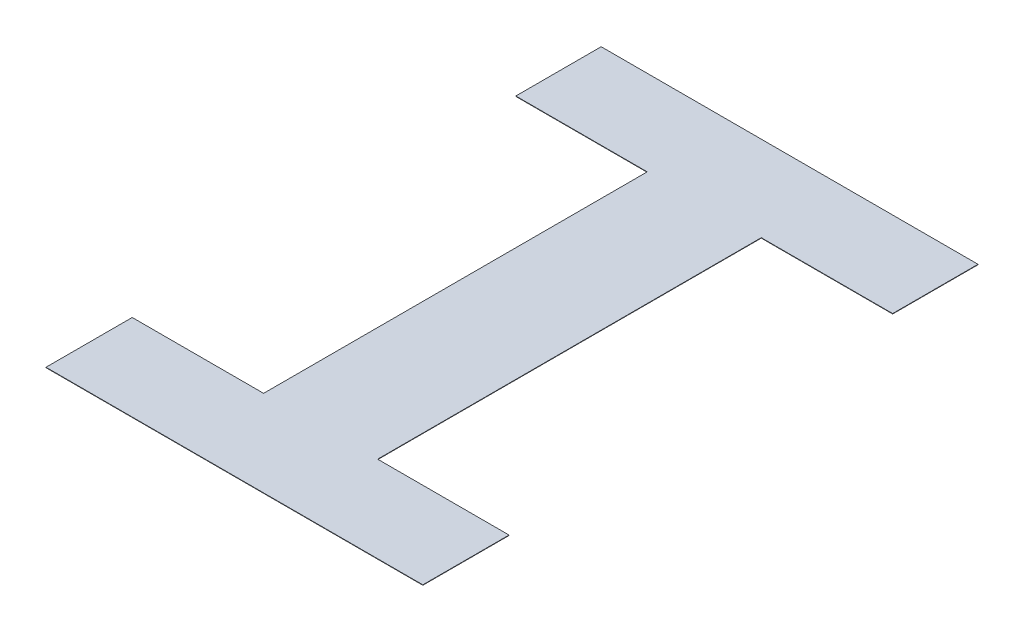
ISO-10303-21;
HEADER;
FILE_DESCRIPTION(('STEP AP214'),'2;1');
FILE_NAME('part.step','',(''),(''),'','','');
FILE_SCHEMA(('AUTOMOTIVE_DESIGN { 1 0 10303 214 1 1 1 1 }'));
ENDSEC;
DATA;
#1=APPLICATION_CONTEXT('core data for automotive mechanical design processes');
#2=APPLICATION_PROTOCOL_DEFINITION('international standard','automotive_design',2000,#1);
#3=PRODUCT_CONTEXT('',#1,'mechanical');
#4=PRODUCT('Part','Part','',(#3));
#5=PRODUCT_RELATED_PRODUCT_CATEGORY('part','',(#4));
#6=PRODUCT_DEFINITION_FORMATION('','',#4);
#7=PRODUCT_DEFINITION_CONTEXT('part definition',#1,'design');
#8=PRODUCT_DEFINITION('design','',#6,#7);
#9=PRODUCT_DEFINITION_SHAPE('','',#8);
#10=(LENGTH_UNIT() NAMED_UNIT(*) SI_UNIT(.MILLI.,.METRE.));
#11=(NAMED_UNIT(*) PLANE_ANGLE_UNIT() SI_UNIT($,.RADIAN.));
#12=(NAMED_UNIT(*) SI_UNIT($,.STERADIAN.) SOLID_ANGLE_UNIT());
#13=UNCERTAINTY_MEASURE_WITH_UNIT(LENGTH_MEASURE(1.E-05),#10,'distance_accuracy_value','');
#14=(GEOMETRIC_REPRESENTATION_CONTEXT(3) GLOBAL_UNCERTAINTY_ASSIGNED_CONTEXT((#13)) GLOBAL_UNIT_ASSIGNED_CONTEXT((#10,
#11,#12)) REPRESENTATION_CONTEXT('',''));
#15=CARTESIAN_POINT('',(0.,0.,0.));
#16=DIRECTION('',(0.,0.,1.));
#17=DIRECTION('',(1.,0.,0.));
#18=AXIS2_PLACEMENT_3D('',#15,#16,#17);
#19=CARTESIAN_POINT('',(26.67,0.00149999999999997,0.));
#20=DIRECTION('',(0.,1.,0.));
#21=DIRECTION('',(0.,0.,1.));
#22=AXIS2_PLACEMENT_3D('',#19,#20,#21);
#23=PLANE('',#22);
#24=DIRECTION('',(0.,0.,1.));
#25=VECTOR('',#24,1.);
#26=CARTESIAN_POINT('',(11.9767874545668,0.00149999999999997,-82.2962675864307));
#27=LINE('',#26,#25);
#28=CARTESIAN_POINT('',(11.9767874545668,0.00149999999999997,-83.6782671330188));
#29=VERTEX_POINT('',#28);
#30=CARTESIAN_POINT('',(11.9767874545668,0.00149999999999997,-82.2962675864307));
#31=VERTEX_POINT('',#30);
#32=EDGE_CURVE('E132',#29,#31,#27,.T.);
#33=ORIENTED_EDGE('',*,*,#32,.T.);
#34=DIRECTION('',(1.,0.,0.));
#35=VECTOR('',#34,1.);
#36=CARTESIAN_POINT('',(12.4501495039887,0.00149999999999997,-82.2962675864307));
#37=LINE('',#36,#35);
#38=CARTESIAN_POINT('',(12.4501495039887,0.00149999999999997,-82.2962675864307));
#39=VERTEX_POINT('',#38);
#40=EDGE_CURVE('E137',#31,#39,#37,.T.);
#41=ORIENTED_EDGE('',*,*,#40,.T.);
#42=DIRECTION('',(0.,0.,1.));
#43=VECTOR('',#42,1.);
#44=CARTESIAN_POINT('',(12.4501495039887,0.00149999999999997,-81.9856804179882));
#45=LINE('',#44,#43);
#46=CARTESIAN_POINT('',(12.4501495039887,0.00149999999999997,-81.9856804179882));
#47=VERTEX_POINT('',#46);
#48=EDGE_CURVE('E145',#39,#47,#45,.T.);
#49=ORIENTED_EDGE('',*,*,#48,.T.);
#50=DIRECTION('',(-1.,0.,0.));
#51=VECTOR('',#50,1.);
#52=CARTESIAN_POINT('',(11.0926342013362,0.00149999999999997,-81.9856804179882));
#53=LINE('',#52,#51);
#54=CARTESIAN_POINT('',(11.0926342013362,0.00149999999999997,-81.9856804179882));
#55=VERTEX_POINT('',#54);
#56=EDGE_CURVE('E152',#47,#55,#53,.T.);
#57=ORIENTED_EDGE('',*,*,#56,.T.);
#58=DIRECTION('',(0.,0.,-1.));
#59=VECTOR('',#58,1.);
#60=CARTESIAN_POINT('',(11.0926342013362,0.00149999999999997,-82.2962675864307));
#61=LINE('',#60,#59);
#62=CARTESIAN_POINT('',(11.0926342013362,0.00149999999999997,-82.2962675864307));
#63=VERTEX_POINT('',#62);
#64=EDGE_CURVE('E159',#55,#63,#61,.T.);
#65=ORIENTED_EDGE('',*,*,#64,.T.);
#66=DIRECTION('',(1.,0.,0.));
#67=VECTOR('',#66,1.);
#68=CARTESIAN_POINT('',(11.5659962507581,0.00149999999999997,-82.2962675864307));
#69=LINE('',#68,#67);
#70=CARTESIAN_POINT('',(11.5659962507581,0.00149999999999997,-82.2962675864307));
#71=VERTEX_POINT('',#70);
#72=EDGE_CURVE('E166',#63,#71,#69,.T.);
#73=ORIENTED_EDGE('',*,*,#72,.T.);
#74=DIRECTION('',(0.,0.,-1.));
#75=VECTOR('',#74,1.);
#76=CARTESIAN_POINT('',(11.5659962507581,0.00149999999999997,-83.6782671330188));
#77=LINE('',#76,#75);
#78=CARTESIAN_POINT('',(11.5659962507581,0.00149999999999997,-83.6782671330188));
#79=VERTEX_POINT('',#78);
#80=EDGE_CURVE('E173',#71,#79,#77,.T.);
#81=ORIENTED_EDGE('',*,*,#80,.T.);
#82=DIRECTION('',(-1.,0.,0.));
#83=VECTOR('',#82,1.);
#84=CARTESIAN_POINT('',(11.0926342013362,0.00149999999999997,-83.6782671330188));
#85=LINE('',#84,#83);
#86=CARTESIAN_POINT('',(11.0926342013362,0.00149999999999997,-83.6782671330188));
#87=VERTEX_POINT('',#86);
#88=EDGE_CURVE('E180',#79,#87,#85,.T.);
#89=ORIENTED_EDGE('',*,*,#88,.T.);
#90=DIRECTION('',(0.,0.,-1.));
#91=VECTOR('',#90,1.);
#92=CARTESIAN_POINT('',(11.0926342013362,0.00149999999999997,-83.9856804179882));
#93=LINE('',#92,#91);
#94=CARTESIAN_POINT('',(11.0926342013362,0.00149999999999997,-83.9856804179882));
#95=VERTEX_POINT('',#94);
#96=EDGE_CURVE('E186',#87,#95,#93,.T.);
#97=ORIENTED_EDGE('',*,*,#96,.T.);
#98=DIRECTION('',(1.,0.,0.));
#99=VECTOR('',#98,1.);
#100=CARTESIAN_POINT('',(12.4501495039887,0.00149999999999997,-83.9856804179882));
#101=LINE('',#100,#99);
#102=CARTESIAN_POINT('',(12.4501495039887,0.00149999999999997,-83.9856804179882));
#103=VERTEX_POINT('',#102);
#104=EDGE_CURVE('E114',#95,#103,#101,.T.);
#105=ORIENTED_EDGE('',*,*,#104,.T.);
#106=DIRECTION('',(0.,0.,1.));
#107=VECTOR('',#106,1.);
#108=CARTESIAN_POINT('',(12.4501495039887,0.00149999999999997,-83.6782671330188));
#109=LINE('',#108,#107);
#110=CARTESIAN_POINT('',(12.4501495039887,0.00149999999999997,-83.6782671330188));
#111=VERTEX_POINT('',#110);
#112=EDGE_CURVE('E112',#103,#111,#109,.T.);
#113=ORIENTED_EDGE('',*,*,#112,.T.);
#114=DIRECTION('',(-1.,0.,0.));
#115=VECTOR('',#114,1.);
#116=CARTESIAN_POINT('',(11.9767874545668,0.00149999999999997,-83.6782671330188));
#117=LINE('',#116,#115);
#118=EDGE_CURVE('E98',#111,#29,#117,.T.);
#119=ORIENTED_EDGE('',*,*,#118,.T.);
#120=EDGE_LOOP('',(#33,#41,#49,#57,#65,#73,#81,#89,#97,#105,#113,#119));
#121=FACE_BOUND('',#120,.T.);
#122=ADVANCED_FACE('F16',(#121),#23,.F.);
#123=CARTESIAN_POINT('',(11.9767874545668,0.00300000000000009,-83.6782671330188));
#124=DIRECTION('',(0.,0.,-1.));
#125=DIRECTION('',(-1.,0.,0.));
#126=AXIS2_PLACEMENT_3D('',#123,#124,#125);
#127=PLANE('',#126);
#128=DIRECTION('',(0.,1.,0.));
#129=VECTOR('',#128,1.);
#130=CARTESIAN_POINT('',(12.4501495039887,0.00300000000000009,-83.6782671330188));
#131=LINE('',#130,#129);
#132=CARTESIAN_POINT('',(12.4501495039887,0.00300000000000009,-83.6782671330188));
#133=VERTEX_POINT('',#132);
#134=EDGE_CURVE('E19',#111,#133,#131,.T.);
#135=ORIENTED_EDGE('',*,*,#134,.T.);
#136=DIRECTION('',(1.,0.,0.));
#137=VECTOR('',#136,1.);
#138=CARTESIAN_POINT('',(26.67,0.00300000000000009,-83.6782671330188));
#139=LINE('',#138,#137);
#140=CARTESIAN_POINT('',(11.9767874545668,0.00300000000000009,-83.6782671330188));
#141=VERTEX_POINT('',#140);
#142=EDGE_CURVE('E128',#141,#133,#139,.T.);
#143=ORIENTED_EDGE('',*,*,#142,.F.);
#144=DIRECTION('',(0.,1.,0.));
#145=VECTOR('',#144,1.);
#146=CARTESIAN_POINT('',(11.9767874545668,0.00300000000000009,-83.6782671330188));
#147=LINE('',#146,#145);
#148=EDGE_CURVE('E106',#141,#29,#147,.F.);
#149=ORIENTED_EDGE('',*,*,#148,.T.);
#150=ORIENTED_EDGE('',*,*,#118,.F.);
#151=EDGE_LOOP('',(#135,#143,#149,#150));
#152=FACE_BOUND('',#151,.T.);
#153=ADVANCED_FACE('F100',(#152),#127,.F.);
#154=CARTESIAN_POINT('',(12.4501495039887,0.00300000000000009,-83.6782671330188));
#155=DIRECTION('',(-1.,0.,0.));
#156=DIRECTION('',(0.,0.,1.));
#157=AXIS2_PLACEMENT_3D('',#154,#155,#156);
#158=PLANE('',#157);
#159=DIRECTION('',(0.,1.,0.));
#160=VECTOR('',#159,1.);
#161=CARTESIAN_POINT('',(12.4501495039887,0.00300000000000009,-83.9856804179882));
#162=LINE('',#161,#160);
#163=CARTESIAN_POINT('',(12.4501495039887,0.00300000000000009,-83.9856804179882));
#164=VERTEX_POINT('',#163);
#165=EDGE_CURVE('E117',#103,#164,#162,.T.);
#166=ORIENTED_EDGE('',*,*,#165,.T.);
#167=DIRECTION('',(0.,0.,1.));
#168=VECTOR('',#167,1.);
#169=CARTESIAN_POINT('',(12.4501495039887,0.00300000000000009,0.));
#170=LINE('',#169,#168);
#171=EDGE_CURVE('E121',#133,#164,#170,.F.);
#172=ORIENTED_EDGE('',*,*,#171,.F.);
#173=ORIENTED_EDGE('',*,*,#134,.F.);
#174=ORIENTED_EDGE('',*,*,#112,.F.);
#175=EDGE_LOOP('',(#166,#172,#173,#174));
#176=FACE_BOUND('',#175,.T.);
#177=ADVANCED_FACE('F119',(#176),#158,.F.);
#178=CARTESIAN_POINT('',(12.4501495039887,0.00300000000000009,-83.9856804179882));
#179=DIRECTION('',(0.,0.,1.));
#180=DIRECTION('',(1.,0.,0.));
#181=AXIS2_PLACEMENT_3D('',#178,#179,#180);
#182=PLANE('',#181);
#183=DIRECTION('',(0.,1.,0.));
#184=VECTOR('',#183,1.);
#185=CARTESIAN_POINT('',(11.0926342013362,0.00300000000000009,-83.9856804179882));
#186=LINE('',#185,#184);
#187=CARTESIAN_POINT('',(11.0926342013362,0.00300000000000009,-83.9856804179882));
#188=VERTEX_POINT('',#187);
#189=EDGE_CURVE('E188',#95,#188,#186,.T.);
#190=ORIENTED_EDGE('',*,*,#189,.T.);
#191=DIRECTION('',(1.,0.,0.));
#192=VECTOR('',#191,1.);
#193=CARTESIAN_POINT('',(26.67,0.00300000000000009,-83.9856804179882));
#194=LINE('',#193,#192);
#195=EDGE_CURVE('E127',#164,#188,#194,.F.);
#196=ORIENTED_EDGE('',*,*,#195,.F.);
#197=ORIENTED_EDGE('',*,*,#165,.F.);
#198=ORIENTED_EDGE('',*,*,#104,.F.);
#199=EDGE_LOOP('',(#190,#196,#197,#198));
#200=FACE_BOUND('',#199,.T.);
#201=ADVANCED_FACE('F203',(#200),#182,.F.);
#202=CARTESIAN_POINT('',(11.0926342013362,0.00300000000000009,-83.9856804179882));
#203=DIRECTION('',(1.,0.,0.));
#204=DIRECTION('',(0.,0.,-1.));
#205=AXIS2_PLACEMENT_3D('',#202,#203,#204);
#206=PLANE('',#205);
#207=DIRECTION('',(0.,1.,0.));
#208=VECTOR('',#207,1.);
#209=CARTESIAN_POINT('',(11.0926342013362,0.00300000000000009,-83.6782671330188));
#210=LINE('',#209,#208);
#211=CARTESIAN_POINT('',(11.0926342013362,0.00300000000000009,-83.6782671330188));
#212=VERTEX_POINT('',#211);
#213=EDGE_CURVE('E183',#87,#212,#210,.T.);
#214=ORIENTED_EDGE('',*,*,#213,.T.);
#215=DIRECTION('',(0.,0.,1.));
#216=VECTOR('',#215,1.);
#217=CARTESIAN_POINT('',(11.0926342013362,0.00300000000000009,0.));
#218=LINE('',#217,#216);
#219=EDGE_CURVE('E179',#188,#212,#218,.T.);
#220=ORIENTED_EDGE('',*,*,#219,.F.);
#221=ORIENTED_EDGE('',*,*,#189,.F.);
#222=ORIENTED_EDGE('',*,*,#96,.F.);
#223=EDGE_LOOP('',(#214,#220,#221,#222));
#224=FACE_BOUND('',#223,.T.);
#225=ADVANCED_FACE('F205',(#224),#206,.F.);
#226=CARTESIAN_POINT('',(11.0926342013362,0.00300000000000009,-83.6782671330188));
#227=DIRECTION('',(0.,0.,-1.));
#228=DIRECTION('',(-1.,0.,0.));
#229=AXIS2_PLACEMENT_3D('',#226,#227,#228);
#230=PLANE('',#229);
#231=DIRECTION('',(0.,1.,0.));
#232=VECTOR('',#231,1.);
#233=CARTESIAN_POINT('',(11.5659962507581,0.00300000000000009,-83.6782671330188));
#234=LINE('',#233,#232);
#235=CARTESIAN_POINT('',(11.5659962507581,0.00300000000000009,-83.6782671330188));
#236=VERTEX_POINT('',#235);
#237=EDGE_CURVE('E176',#79,#236,#234,.T.);
#238=ORIENTED_EDGE('',*,*,#237,.T.);
#239=DIRECTION('',(1.,0.,0.));
#240=VECTOR('',#239,1.);
#241=CARTESIAN_POINT('',(26.67,0.00300000000000009,-83.6782671330188));
#242=LINE('',#241,#240);
#243=EDGE_CURVE('E172',#212,#236,#242,.T.);
#244=ORIENTED_EDGE('',*,*,#243,.F.);
#245=ORIENTED_EDGE('',*,*,#213,.F.);
#246=ORIENTED_EDGE('',*,*,#88,.F.);
#247=EDGE_LOOP('',(#238,#244,#245,#246));
#248=FACE_BOUND('',#247,.T.);
#249=ADVANCED_FACE('F210',(#248),#230,.F.);
#250=CARTESIAN_POINT('',(11.5659962507581,0.00300000000000009,-83.6782671330188));
#251=DIRECTION('',(1.,0.,0.));
#252=DIRECTION('',(0.,0.,-1.));
#253=AXIS2_PLACEMENT_3D('',#250,#251,#252);
#254=PLANE('',#253);
#255=DIRECTION('',(0.,1.,0.));
#256=VECTOR('',#255,1.);
#257=CARTESIAN_POINT('',(11.5659962507581,0.00300000000000009,-82.2962675864307));
#258=LINE('',#257,#256);
#259=CARTESIAN_POINT('',(11.5659962507581,0.00300000000000009,-82.2962675864307));
#260=VERTEX_POINT('',#259);
#261=EDGE_CURVE('E169',#71,#260,#258,.T.);
#262=ORIENTED_EDGE('',*,*,#261,.T.);
#263=DIRECTION('',(0.,0.,1.));
#264=VECTOR('',#263,1.);
#265=CARTESIAN_POINT('',(11.5659962507581,0.00300000000000009,0.));
#266=LINE('',#265,#264);
#267=EDGE_CURVE('E165',#236,#260,#266,.T.);
#268=ORIENTED_EDGE('',*,*,#267,.F.);
#269=ORIENTED_EDGE('',*,*,#237,.F.);
#270=ORIENTED_EDGE('',*,*,#80,.F.);
#271=EDGE_LOOP('',(#262,#268,#269,#270));
#272=FACE_BOUND('',#271,.T.);
#273=ADVANCED_FACE('F213',(#272),#254,.F.);
#274=CARTESIAN_POINT('',(11.5659962507581,0.00300000000000009,-82.2962675864307));
#275=DIRECTION('',(0.,0.,1.));
#276=DIRECTION('',(1.,0.,0.));
#277=AXIS2_PLACEMENT_3D('',#274,#275,#276);
#278=PLANE('',#277);
#279=DIRECTION('',(0.,1.,0.));
#280=VECTOR('',#279,1.);
#281=CARTESIAN_POINT('',(11.0926342013362,0.00300000000000009,-82.2962675864307));
#282=LINE('',#281,#280);
#283=CARTESIAN_POINT('',(11.0926342013362,0.00300000000000009,-82.2962675864307));
#284=VERTEX_POINT('',#283);
#285=EDGE_CURVE('E162',#63,#284,#282,.T.);
#286=ORIENTED_EDGE('',*,*,#285,.T.);
#287=DIRECTION('',(1.,0.,0.));
#288=VECTOR('',#287,1.);
#289=CARTESIAN_POINT('',(26.67,0.00300000000000009,-82.2962675864307));
#290=LINE('',#289,#288);
#291=EDGE_CURVE('E158',#260,#284,#290,.F.);
#292=ORIENTED_EDGE('',*,*,#291,.F.);
#293=ORIENTED_EDGE('',*,*,#261,.F.);
#294=ORIENTED_EDGE('',*,*,#72,.F.);
#295=EDGE_LOOP('',(#286,#292,#293,#294));
#296=FACE_BOUND('',#295,.T.);
#297=ADVANCED_FACE('F217',(#296),#278,.F.);
#298=CARTESIAN_POINT('',(11.0926342013362,0.00300000000000009,-82.2962675864307));
#299=DIRECTION('',(1.,0.,0.));
#300=DIRECTION('',(0.,0.,-1.));
#301=AXIS2_PLACEMENT_3D('',#298,#299,#300);
#302=PLANE('',#301);
#303=DIRECTION('',(0.,1.,0.));
#304=VECTOR('',#303,1.);
#305=CARTESIAN_POINT('',(11.0926342013362,0.00300000000000009,-81.9856804179882));
#306=LINE('',#305,#304);
#307=CARTESIAN_POINT('',(11.0926342013362,0.00300000000000009,-81.9856804179882));
#308=VERTEX_POINT('',#307);
#309=EDGE_CURVE('E155',#55,#308,#306,.T.);
#310=ORIENTED_EDGE('',*,*,#309,.T.);
#311=DIRECTION('',(0.,0.,1.));
#312=VECTOR('',#311,1.);
#313=CARTESIAN_POINT('',(11.0926342013362,0.00300000000000009,0.));
#314=LINE('',#313,#312);
#315=EDGE_CURVE('E151',#284,#308,#314,.T.);
#316=ORIENTED_EDGE('',*,*,#315,.F.);
#317=ORIENTED_EDGE('',*,*,#285,.F.);
#318=ORIENTED_EDGE('',*,*,#64,.F.);
#319=EDGE_LOOP('',(#310,#316,#317,#318));
#320=FACE_BOUND('',#319,.T.);
#321=ADVANCED_FACE('F222',(#320),#302,.F.);
#322=CARTESIAN_POINT('',(11.0926342013362,0.00300000000000009,-81.9856804179882));
#323=DIRECTION('',(0.,0.,-1.));
#324=DIRECTION('',(-1.,0.,0.));
#325=AXIS2_PLACEMENT_3D('',#322,#323,#324);
#326=PLANE('',#325);
#327=DIRECTION('',(0.,1.,0.));
#328=VECTOR('',#327,1.);
#329=CARTESIAN_POINT('',(12.4501495039887,0.00300000000000009,-81.9856804179882));
#330=LINE('',#329,#328);
#331=CARTESIAN_POINT('',(12.4501495039887,0.00300000000000009,-81.9856804179882));
#332=VERTEX_POINT('',#331);
#333=EDGE_CURVE('E148',#47,#332,#330,.T.);
#334=ORIENTED_EDGE('',*,*,#333,.T.);
#335=DIRECTION('',(1.,0.,0.));
#336=VECTOR('',#335,1.);
#337=CARTESIAN_POINT('',(26.67,0.00300000000000009,-81.9856804179882));
#338=LINE('',#337,#336);
#339=EDGE_CURVE('E144',#308,#332,#338,.T.);
#340=ORIENTED_EDGE('',*,*,#339,.F.);
#341=ORIENTED_EDGE('',*,*,#309,.F.);
#342=ORIENTED_EDGE('',*,*,#56,.F.);
#343=EDGE_LOOP('',(#334,#340,#341,#342));
#344=FACE_BOUND('',#343,.T.);
#345=ADVANCED_FACE('F225',(#344),#326,.F.);
#346=CARTESIAN_POINT('',(12.4501495039887,0.00300000000000009,-81.9856804179882));
#347=DIRECTION('',(-1.,0.,0.));
#348=DIRECTION('',(0.,0.,1.));
#349=AXIS2_PLACEMENT_3D('',#346,#347,#348);
#350=PLANE('',#349);
#351=DIRECTION('',(0.,1.,0.));
#352=VECTOR('',#351,1.);
#353=CARTESIAN_POINT('',(12.4501495039887,0.00300000000000009,-82.2962675864307));
#354=LINE('',#353,#352);
#355=CARTESIAN_POINT('',(12.4501495039887,0.00300000000000009,-82.2962675864307));
#356=VERTEX_POINT('',#355);
#357=EDGE_CURVE('E140',#39,#356,#354,.T.);
#358=ORIENTED_EDGE('',*,*,#357,.T.);
#359=DIRECTION('',(0.,0.,1.));
#360=VECTOR('',#359,1.);
#361=CARTESIAN_POINT('',(12.4501495039887,0.00300000000000009,0.));
#362=LINE('',#361,#360);
#363=EDGE_CURVE('E141',#332,#356,#362,.F.);
#364=ORIENTED_EDGE('',*,*,#363,.F.);
#365=ORIENTED_EDGE('',*,*,#333,.F.);
#366=ORIENTED_EDGE('',*,*,#48,.F.);
#367=EDGE_LOOP('',(#358,#364,#365,#366));
#368=FACE_BOUND('',#367,.T.);
#369=ADVANCED_FACE('F229',(#368),#350,.F.);
#370=CARTESIAN_POINT('',(12.4501495039887,0.00300000000000009,-82.2962675864307));
#371=DIRECTION('',(0.,0.,1.));
#372=DIRECTION('',(1.,0.,0.));
#373=AXIS2_PLACEMENT_3D('',#370,#371,#372);
#374=PLANE('',#373);
#375=DIRECTION('',(0.,1.,0.));
#376=VECTOR('',#375,1.);
#377=CARTESIAN_POINT('',(11.9767874545668,0.00300000000000009,-82.2962675864307));
#378=LINE('',#377,#376);
#379=CARTESIAN_POINT('',(11.9767874545668,0.00300000000000009,-82.2962675864307));
#380=VERTEX_POINT('',#379);
#381=EDGE_CURVE('E34',#31,#380,#378,.T.);
#382=ORIENTED_EDGE('',*,*,#381,.T.);
#383=DIRECTION('',(1.,0.,0.));
#384=VECTOR('',#383,1.);
#385=CARTESIAN_POINT('',(26.67,0.00300000000000009,-82.2962675864307));
#386=LINE('',#385,#384);
#387=EDGE_CURVE('E25',#356,#380,#386,.F.);
#388=ORIENTED_EDGE('',*,*,#387,.F.);
#389=ORIENTED_EDGE('',*,*,#357,.F.);
#390=ORIENTED_EDGE('',*,*,#40,.F.);
#391=EDGE_LOOP('',(#382,#388,#389,#390));
#392=FACE_BOUND('',#391,.T.);
#393=ADVANCED_FACE('F231',(#392),#374,.F.);
#394=CARTESIAN_POINT('',(11.9767874545668,0.00300000000000009,-82.2962675864307));
#395=DIRECTION('',(-1.,0.,0.));
#396=DIRECTION('',(0.,0.,1.));
#397=AXIS2_PLACEMENT_3D('',#394,#395,#396);
#398=PLANE('',#397);
#399=ORIENTED_EDGE('',*,*,#148,.F.);
#400=DIRECTION('',(0.,0.,1.));
#401=VECTOR('',#400,1.);
#402=CARTESIAN_POINT('',(11.9767874545668,0.00300000000000009,0.));
#403=LINE('',#402,#401);
#404=EDGE_CURVE('E11',#380,#141,#403,.F.);
#405=ORIENTED_EDGE('',*,*,#404,.F.);
#406=ORIENTED_EDGE('',*,*,#381,.F.);
#407=ORIENTED_EDGE('',*,*,#32,.F.);
#408=EDGE_LOOP('',(#399,#405,#406,#407));
#409=FACE_BOUND('',#408,.T.);
#410=ADVANCED_FACE('F233',(#409),#398,.F.);
#411=CARTESIAN_POINT('',(26.67,0.00300000000000009,0.));
#412=DIRECTION('',(0.,1.,0.));
#413=DIRECTION('',(0.,0.,1.));
#414=AXIS2_PLACEMENT_3D('',#411,#412,#413);
#415=PLANE('',#414);
#416=ORIENTED_EDGE('',*,*,#387,.T.);
#417=ORIENTED_EDGE('',*,*,#404,.T.);
#418=ORIENTED_EDGE('',*,*,#142,.T.);
#419=ORIENTED_EDGE('',*,*,#171,.T.);
#420=ORIENTED_EDGE('',*,*,#195,.T.);
#421=ORIENTED_EDGE('',*,*,#219,.T.);
#422=ORIENTED_EDGE('',*,*,#243,.T.);
#423=ORIENTED_EDGE('',*,*,#267,.T.);
#424=ORIENTED_EDGE('',*,*,#291,.T.);
#425=ORIENTED_EDGE('',*,*,#315,.T.);
#426=ORIENTED_EDGE('',*,*,#339,.T.);
#427=ORIENTED_EDGE('',*,*,#363,.T.);
#428=EDGE_LOOP('',(#416,#417,#418,#419,#420,#421,#422,#423,#424,#425,#426,#427));
#429=FACE_BOUND('',#428,.T.);
#430=ADVANCED_FACE('F131',(#429),#415,.T.);
#431=CLOSED_SHELL('',(#122,#153,#177,#201,#225,#249,#273,#297,#321,#345,#369,#393,#410,#430));
#432=MANIFOLD_SOLID_BREP('B1',#431);
#433=ADVANCED_BREP_SHAPE_REPRESENTATION('',(#18,#432),#14);
#434=SHAPE_DEFINITION_REPRESENTATION(#9,#433);
ENDSEC;
END-ISO-10303-21;
